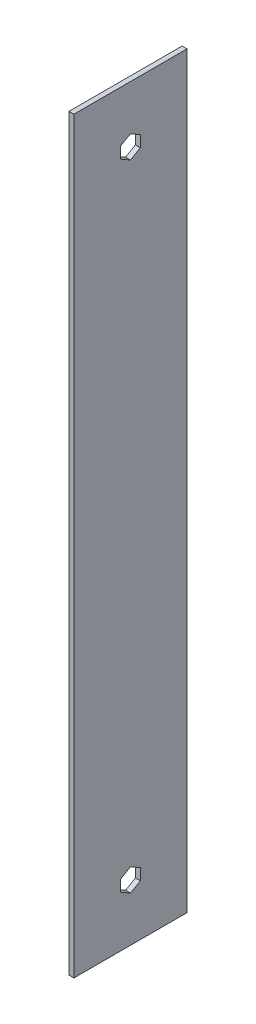
ISO-10303-21;
HEADER;
FILE_DESCRIPTION(('STEP AP214'),'2;1');
FILE_NAME('part.step','',(''),(''),'','','');
FILE_SCHEMA(('AUTOMOTIVE_DESIGN { 1 0 10303 214 1 1 1 1 }'));
ENDSEC;
DATA;
#1=APPLICATION_CONTEXT('core data for automotive mechanical design processes');
#2=APPLICATION_PROTOCOL_DEFINITION('international standard','automotive_design',2000,#1);
#3=PRODUCT_CONTEXT('',#1,'mechanical');
#4=PRODUCT('Part','Part','',(#3));
#5=PRODUCT_RELATED_PRODUCT_CATEGORY('part','',(#4));
#6=PRODUCT_DEFINITION_FORMATION('','',#4);
#7=PRODUCT_DEFINITION_CONTEXT('part definition',#1,'design');
#8=PRODUCT_DEFINITION('design','',#6,#7);
#9=PRODUCT_DEFINITION_SHAPE('','',#8);
#10=(LENGTH_UNIT() NAMED_UNIT(*) SI_UNIT(.MILLI.,.METRE.));
#11=(NAMED_UNIT(*) PLANE_ANGLE_UNIT() SI_UNIT($,.RADIAN.));
#12=(NAMED_UNIT(*) SI_UNIT($,.STERADIAN.) SOLID_ANGLE_UNIT());
#13=UNCERTAINTY_MEASURE_WITH_UNIT(LENGTH_MEASURE(1.E-05),#10,'distance_accuracy_value','');
#14=(GEOMETRIC_REPRESENTATION_CONTEXT(3) GLOBAL_UNCERTAINTY_ASSIGNED_CONTEXT((#13)) GLOBAL_UNIT_ASSIGNED_CONTEXT((#10,
#11,#12)) REPRESENTATION_CONTEXT('',''));
#15=CARTESIAN_POINT('',(0.,0.,0.));
#16=DIRECTION('',(0.,0.,1.));
#17=DIRECTION('',(1.,0.,0.));
#18=AXIS2_PLACEMENT_3D('',#15,#16,#17);
#19=CARTESIAN_POINT('',(1.5875,0.,0.));
#20=DIRECTION('',(1.,0.,0.));
#21=DIRECTION('',(0.,0.,-1.));
#22=AXIS2_PLACEMENT_3D('',#19,#20,#21);
#23=PLANE('',#22);
#24=DIRECTION('',(0.,-1.,0.));
#25=VECTOR('',#24,1.);
#26=CARTESIAN_POINT('',(1.5875,446.0875,36.5125000000001));
#27=LINE('',#26,#25);
#28=CARTESIAN_POINT('',(1.5875,446.0875,36.5125000000001));
#29=VERTEX_POINT('',#28);
#30=CARTESIAN_POINT('',(1.5875,-36.5125,36.5125));
#31=VERTEX_POINT('',#30);
#32=EDGE_CURVE('E242',#29,#31,#27,.T.);
#33=ORIENTED_EDGE('',*,*,#32,.T.);
#34=DIRECTION('',(0.,0.,-1.));
#35=VECTOR('',#34,1.);
#36=CARTESIAN_POINT('',(1.5875,-36.5125,36.5125));
#37=LINE('',#36,#35);
#38=CARTESIAN_POINT('',(1.5875,-36.5125,-36.5125));
#39=VERTEX_POINT('',#38);
#40=EDGE_CURVE('E245',#31,#39,#37,.T.);
#41=ORIENTED_EDGE('',*,*,#40,.T.);
#42=DIRECTION('',(0.,1.,0.));
#43=VECTOR('',#42,1.);
#44=CARTESIAN_POINT('',(1.5875,446.0875,-36.5124999999999));
#45=LINE('',#44,#43);
#46=CARTESIAN_POINT('',(1.5875,446.0875,-36.5124999999999));
#47=VERTEX_POINT('',#46);
#48=EDGE_CURVE('E248',#39,#47,#45,.T.);
#49=ORIENTED_EDGE('',*,*,#48,.T.);
#50=DIRECTION('',(0.,0.,1.));
#51=VECTOR('',#50,1.);
#52=CARTESIAN_POINT('',(1.5875,446.0875,36.5125000000001));
#53=LINE('',#52,#51);
#54=EDGE_CURVE('E250',#47,#29,#53,.T.);
#55=ORIENTED_EDGE('',*,*,#54,.T.);
#56=EDGE_LOOP('',(#33,#41,#49,#55));
#57=FACE_BOUND('',#56,.T.);
#58=DIRECTION('',(0.,-0.500000000000028,0.866025403784422));
#59=VECTOR('',#58,1.);
#60=CARTESIAN_POINT('',(1.5875,7.33234841870825,2.3952736495636E-13));
#61=LINE('',#60,#59);
#62=CARTESIAN_POINT('',(1.5875,7.33234841870825,2.3952736495636E-13));
#63=VERTEX_POINT('',#62);
#64=CARTESIAN_POINT('',(1.5875,3.666174209354,6.34999999999997));
#65=VERTEX_POINT('',#64);
#66=EDGE_CURVE('E199',#63,#65,#61,.T.);
#67=ORIENTED_EDGE('',*,*,#66,.F.);
#68=DIRECTION('',(0.,0.499999999999986,0.866025403784447));
#69=VECTOR('',#68,1.);
#70=CARTESIAN_POINT('',(1.5875,3.66617420935413,-6.34999999999999));
#71=LINE('',#70,#69);
#72=CARTESIAN_POINT('',(1.5875,3.66617420935413,-6.34999999999999));
#73=VERTEX_POINT('',#72);
#74=EDGE_CURVE('E197',#73,#63,#71,.T.);
#75=ORIENTED_EDGE('',*,*,#74,.F.);
#76=DIRECTION('',(0.,1.,0.));
#77=VECTOR('',#76,1.);
#78=CARTESIAN_POINT('',(1.5875,-3.66617420935413,-6.35));
#79=LINE('',#78,#77);
#80=CARTESIAN_POINT('',(1.5875,-3.66617420935413,-6.35));
#81=VERTEX_POINT('',#80);
#82=EDGE_CURVE('E209',#81,#73,#79,.T.);
#83=ORIENTED_EDGE('',*,*,#82,.F.);
#84=DIRECTION('',(0.,0.5,-0.866025403784439));
#85=VECTOR('',#84,1.);
#86=CARTESIAN_POINT('',(1.5875,-7.33234841870825,0.));
#87=LINE('',#86,#85);
#88=CARTESIAN_POINT('',(1.5875,-7.33234841870825,0.));
#89=VERTEX_POINT('',#88);
#90=EDGE_CURVE('E206',#89,#81,#87,.T.);
#91=ORIENTED_EDGE('',*,*,#90,.F.);
#92=DIRECTION('',(0.,-0.5,-0.866025403784439));
#93=VECTOR('',#92,1.);
#94=CARTESIAN_POINT('',(1.5875,-3.66617420935412,6.35));
#95=LINE('',#94,#93);
#96=CARTESIAN_POINT('',(1.5875,-3.66617420935412,6.35));
#97=VERTEX_POINT('',#96);
#98=EDGE_CURVE('E204',#97,#89,#95,.T.);
#99=ORIENTED_EDGE('',*,*,#98,.F.);
#100=DIRECTION('',(0.,-1.,0.));
#101=VECTOR('',#100,1.);
#102=CARTESIAN_POINT('',(1.5875,3.666174209354,6.34999999999997));
#103=LINE('',#102,#101);
#104=EDGE_CURVE('E202',#65,#97,#103,.T.);
#105=ORIENTED_EDGE('',*,*,#104,.F.);
#106=EDGE_LOOP('',(#67,#75,#83,#91,#99,#105));
#107=FACE_BOUND('',#106,.T.);
#108=DIRECTION('',(0.,0.499999999999997,-0.86602540378444));
#109=VECTOR('',#108,1.);
#110=CARTESIAN_POINT('',(1.5875,402.242651581292,0.));
#111=LINE('',#110,#109);
#112=CARTESIAN_POINT('',(1.5875,402.242651581292,0.));
#113=VERTEX_POINT('',#112);
#114=CARTESIAN_POINT('',(1.5875,405.908825790646,-6.35000000000002));
#115=VERTEX_POINT('',#114);
#116=EDGE_CURVE('E154',#113,#115,#111,.T.);
#117=ORIENTED_EDGE('',*,*,#116,.F.);
#118=DIRECTION('',(0.,-0.5,-0.866025403784439));
#119=VECTOR('',#118,1.);
#120=CARTESIAN_POINT('',(1.5875,405.908825790646,6.35));
#121=LINE('',#120,#119);
#122=CARTESIAN_POINT('',(1.5875,405.908825790646,6.35));
#123=VERTEX_POINT('',#122);
#124=EDGE_CURVE('E146',#123,#113,#121,.T.);
#125=ORIENTED_EDGE('',*,*,#124,.F.);
#126=DIRECTION('',(0.,-1.,0.));
#127=VECTOR('',#126,1.);
#128=CARTESIAN_POINT('',(1.5875,413.241174209354,6.35));
#129=LINE('',#128,#127);
#130=CARTESIAN_POINT('',(1.5875,413.241174209354,6.35));
#131=VERTEX_POINT('',#130);
#132=EDGE_CURVE('E175',#131,#123,#129,.T.);
#133=ORIENTED_EDGE('',*,*,#132,.F.);
#134=DIRECTION('',(0.,-0.499999999999999,0.866025403784439));
#135=VECTOR('',#134,1.);
#136=CARTESIAN_POINT('',(1.5875,416.907348418708,0.));
#137=LINE('',#136,#135);
#138=CARTESIAN_POINT('',(1.5875,416.907348418708,0.));
#139=VERTEX_POINT('',#138);
#140=EDGE_CURVE('E173',#139,#131,#137,.T.);
#141=ORIENTED_EDGE('',*,*,#140,.F.);
#142=DIRECTION('',(0.,0.499999999999998,0.86602540378444));
#143=VECTOR('',#142,1.);
#144=CARTESIAN_POINT('',(1.5875,413.241174209354,-6.35000000000002));
#145=LINE('',#144,#143);
#146=CARTESIAN_POINT('',(1.5875,413.241174209354,-6.35000000000002));
#147=VERTEX_POINT('',#146);
#148=EDGE_CURVE('E169',#147,#139,#145,.T.);
#149=ORIENTED_EDGE('',*,*,#148,.F.);
#150=DIRECTION('',(0.,1.,0.));
#151=VECTOR('',#150,1.);
#152=CARTESIAN_POINT('',(1.5875,405.908825790646,-6.35000000000002));
#153=LINE('',#152,#151);
#154=EDGE_CURVE('E167',#115,#147,#153,.T.);
#155=ORIENTED_EDGE('',*,*,#154,.F.);
#156=EDGE_LOOP('',(#117,#125,#133,#141,#149,#155));
#157=FACE_BOUND('',#156,.T.);
#158=ADVANCED_FACE('F33',(#57,#107,#157),#23,.T.);
#159=CARTESIAN_POINT('',(-1.5875,0.,0.));
#160=DIRECTION('',(1.,0.,0.));
#161=DIRECTION('',(0.,0.,-1.));
#162=AXIS2_PLACEMENT_3D('',#159,#160,#161);
#163=PLANE('',#162);
#164=DIRECTION('',(0.,0.499999999999986,0.866025403784447));
#165=VECTOR('',#164,1.);
#166=CARTESIAN_POINT('',(-1.5875,3.66617420935413,-6.34999999999999));
#167=LINE('',#166,#165);
#168=CARTESIAN_POINT('',(-1.5875,3.66617420935413,-6.34999999999999));
#169=VERTEX_POINT('',#168);
#170=CARTESIAN_POINT('',(-1.5875,7.33234841870825,2.3952736495636E-13));
#171=VERTEX_POINT('',#170);
#172=EDGE_CURVE('E162',#169,#171,#167,.T.);
#173=ORIENTED_EDGE('',*,*,#172,.T.);
#174=DIRECTION('',(0.,-0.500000000000028,0.866025403784422));
#175=VECTOR('',#174,1.);
#176=CARTESIAN_POINT('',(-1.5875,7.33234841870825,2.3952736495636E-13));
#177=LINE('',#176,#175);
#178=CARTESIAN_POINT('',(-1.5875,3.666174209354,6.34999999999997));
#179=VERTEX_POINT('',#178);
#180=EDGE_CURVE('E214',#171,#179,#177,.T.);
#181=ORIENTED_EDGE('',*,*,#180,.T.);
#182=DIRECTION('',(0.,-1.,0.));
#183=VECTOR('',#182,1.);
#184=CARTESIAN_POINT('',(-1.5875,3.666174209354,6.34999999999997));
#185=LINE('',#184,#183);
#186=CARTESIAN_POINT('',(-1.5875,-3.66617420935412,6.35));
#187=VERTEX_POINT('',#186);
#188=EDGE_CURVE('E217',#179,#187,#185,.T.);
#189=ORIENTED_EDGE('',*,*,#188,.T.);
#190=DIRECTION('',(0.,-0.5,-0.866025403784439));
#191=VECTOR('',#190,1.);
#192=CARTESIAN_POINT('',(-1.5875,-3.66617420935412,6.35));
#193=LINE('',#192,#191);
#194=CARTESIAN_POINT('',(-1.5875,-7.33234841870825,0.));
#195=VERTEX_POINT('',#194);
#196=EDGE_CURVE('E220',#187,#195,#193,.T.);
#197=ORIENTED_EDGE('',*,*,#196,.T.);
#198=DIRECTION('',(0.,0.5,-0.866025403784439));
#199=VECTOR('',#198,1.);
#200=CARTESIAN_POINT('',(-1.5875,-7.33234841870825,0.));
#201=LINE('',#200,#199);
#202=CARTESIAN_POINT('',(-1.5875,-3.66617420935413,-6.35));
#203=VERTEX_POINT('',#202);
#204=EDGE_CURVE('E223',#195,#203,#201,.T.);
#205=ORIENTED_EDGE('',*,*,#204,.T.);
#206=DIRECTION('',(0.,1.,0.));
#207=VECTOR('',#206,1.);
#208=CARTESIAN_POINT('',(-1.5875,-3.66617420935413,-6.35));
#209=LINE('',#208,#207);
#210=EDGE_CURVE('E200',#203,#169,#209,.T.);
#211=ORIENTED_EDGE('',*,*,#210,.T.);
#212=EDGE_LOOP('',(#173,#181,#189,#197,#205,#211));
#213=FACE_BOUND('',#212,.T.);
#214=DIRECTION('',(0.,-1.,0.));
#215=VECTOR('',#214,1.);
#216=CARTESIAN_POINT('',(-1.5875,446.0875,36.5125000000001));
#217=LINE('',#216,#215);
#218=CARTESIAN_POINT('',(-1.5875,446.0875,36.5125000000001));
#219=VERTEX_POINT('',#218);
#220=CARTESIAN_POINT('',(-1.5875,-36.5125,36.5125));
#221=VERTEX_POINT('',#220);
#222=EDGE_CURVE('E241',#219,#221,#217,.T.);
#223=ORIENTED_EDGE('',*,*,#222,.F.);
#224=DIRECTION('',(0.,0.,1.));
#225=VECTOR('',#224,1.);
#226=CARTESIAN_POINT('',(-1.5875,446.0875,36.5125000000001));
#227=LINE('',#226,#225);
#228=CARTESIAN_POINT('',(-1.5875,446.0875,-36.5124999999999));
#229=VERTEX_POINT('',#228);
#230=EDGE_CURVE('E246',#229,#219,#227,.T.);
#231=ORIENTED_EDGE('',*,*,#230,.F.);
#232=DIRECTION('',(0.,1.,0.));
#233=VECTOR('',#232,1.);
#234=CARTESIAN_POINT('',(-1.5875,446.0875,-36.5124999999999));
#235=LINE('',#234,#233);
#236=CARTESIAN_POINT('',(-1.5875,-36.5125,-36.5125));
#237=VERTEX_POINT('',#236);
#238=EDGE_CURVE('E257',#237,#229,#235,.T.);
#239=ORIENTED_EDGE('',*,*,#238,.F.);
#240=DIRECTION('',(0.,0.,-1.));
#241=VECTOR('',#240,1.);
#242=CARTESIAN_POINT('',(-1.5875,-36.5125,36.5125));
#243=LINE('',#242,#241);
#244=EDGE_CURVE('E255',#221,#237,#243,.T.);
#245=ORIENTED_EDGE('',*,*,#244,.F.);
#246=EDGE_LOOP('',(#223,#231,#239,#245));
#247=FACE_BOUND('',#246,.T.);
#248=DIRECTION('',(0.,-0.5,-0.866025403784439));
#249=VECTOR('',#248,1.);
#250=CARTESIAN_POINT('',(-1.5875,405.908825790646,6.35));
#251=LINE('',#250,#249);
#252=CARTESIAN_POINT('',(-1.5875,405.908825790646,6.35));
#253=VERTEX_POINT('',#252);
#254=CARTESIAN_POINT('',(-1.5875,402.242651581292,0.));
#255=VERTEX_POINT('',#254);
#256=EDGE_CURVE('E56',#253,#255,#251,.T.);
#257=ORIENTED_EDGE('',*,*,#256,.T.);
#258=DIRECTION('',(0.,0.499999999999997,-0.86602540378444));
#259=VECTOR('',#258,1.);
#260=CARTESIAN_POINT('',(-1.5875,402.242651581292,0.));
#261=LINE('',#260,#259);
#262=CARTESIAN_POINT('',(-1.5875,405.908825790646,-6.35000000000002));
#263=VERTEX_POINT('',#262);
#264=EDGE_CURVE('E161',#255,#263,#261,.T.);
#265=ORIENTED_EDGE('',*,*,#264,.T.);
#266=DIRECTION('',(0.,1.,0.));
#267=VECTOR('',#266,1.);
#268=CARTESIAN_POINT('',(-1.5875,405.908825790646,-6.35000000000002));
#269=LINE('',#268,#267);
#270=CARTESIAN_POINT('',(-1.5875,413.241174209354,-6.35000000000002));
#271=VERTEX_POINT('',#270);
#272=EDGE_CURVE('E179',#263,#271,#269,.T.);
#273=ORIENTED_EDGE('',*,*,#272,.T.);
#274=DIRECTION('',(0.,0.499999999999998,0.86602540378444));
#275=VECTOR('',#274,1.);
#276=CARTESIAN_POINT('',(-1.5875,413.241174209354,-6.35000000000002));
#277=LINE('',#276,#275);
#278=CARTESIAN_POINT('',(-1.5875,416.907348418708,0.));
#279=VERTEX_POINT('',#278);
#280=EDGE_CURVE('E182',#271,#279,#277,.T.);
#281=ORIENTED_EDGE('',*,*,#280,.T.);
#282=DIRECTION('',(0.,-0.499999999999999,0.866025403784439));
#283=VECTOR('',#282,1.);
#284=CARTESIAN_POINT('',(-1.5875,416.907348418708,0.));
#285=LINE('',#284,#283);
#286=CARTESIAN_POINT('',(-1.5875,413.241174209354,6.35));
#287=VERTEX_POINT('',#286);
#288=EDGE_CURVE('E185',#279,#287,#285,.T.);
#289=ORIENTED_EDGE('',*,*,#288,.T.);
#290=DIRECTION('',(0.,-1.,0.));
#291=VECTOR('',#290,1.);
#292=CARTESIAN_POINT('',(-1.5875,413.241174209354,6.35));
#293=LINE('',#292,#291);
#294=EDGE_CURVE('E155',#287,#253,#293,.T.);
#295=ORIENTED_EDGE('',*,*,#294,.T.);
#296=EDGE_LOOP('',(#257,#265,#273,#281,#289,#295));
#297=FACE_BOUND('',#296,.T.);
#298=ADVANCED_FACE('F275',(#213,#247,#297),#163,.F.);
#299=CARTESIAN_POINT('',(1.5875,446.0875,36.5125000000001));
#300=DIRECTION('',(0.,0.,-1.));
#301=DIRECTION('',(0.,1.,0.));
#302=AXIS2_PLACEMENT_3D('',#299,#300,#301);
#303=PLANE('',#302);
#304=ORIENTED_EDGE('',*,*,#222,.T.);
#305=DIRECTION('',(-1.,0.,0.));
#306=VECTOR('',#305,1.);
#307=CARTESIAN_POINT('',(1.5875,-36.5125,36.5125));
#308=LINE('',#307,#306);
#309=EDGE_CURVE('E11',#31,#221,#308,.T.);
#310=ORIENTED_EDGE('',*,*,#309,.F.);
#311=ORIENTED_EDGE('',*,*,#32,.F.);
#312=DIRECTION('',(-1.,0.,0.));
#313=VECTOR('',#312,1.);
#314=CARTESIAN_POINT('',(1.5875,446.0875,36.5125000000001));
#315=LINE('',#314,#313);
#316=EDGE_CURVE('E252',#29,#219,#315,.T.);
#317=ORIENTED_EDGE('',*,*,#316,.T.);
#318=EDGE_LOOP('',(#304,#310,#311,#317));
#319=FACE_BOUND('',#318,.T.);
#320=ADVANCED_FACE('F35',(#319),#303,.F.);
#321=CARTESIAN_POINT('',(1.5875,-36.5125,36.5125));
#322=DIRECTION('',(0.,1.,0.));
#323=DIRECTION('',(0.,0.,1.));
#324=AXIS2_PLACEMENT_3D('',#321,#322,#323);
#325=PLANE('',#324);
#326=ORIENTED_EDGE('',*,*,#244,.T.);
#327=DIRECTION('',(-1.,0.,0.));
#328=VECTOR('',#327,1.);
#329=CARTESIAN_POINT('',(1.5875,-36.5125,-36.5125));
#330=LINE('',#329,#328);
#331=EDGE_CURVE('E41',#39,#237,#330,.T.);
#332=ORIENTED_EDGE('',*,*,#331,.F.);
#333=ORIENTED_EDGE('',*,*,#40,.F.);
#334=ORIENTED_EDGE('',*,*,#309,.T.);
#335=EDGE_LOOP('',(#326,#332,#333,#334));
#336=FACE_BOUND('',#335,.T.);
#337=ADVANCED_FACE('F286',(#336),#325,.F.);
#338=CARTESIAN_POINT('',(1.5875,446.0875,-36.5124999999999));
#339=DIRECTION('',(0.,0.,1.));
#340=DIRECTION('',(0.,-1.,0.));
#341=AXIS2_PLACEMENT_3D('',#338,#339,#340);
#342=PLANE('',#341);
#343=ORIENTED_EDGE('',*,*,#238,.T.);
#344=DIRECTION('',(-1.,0.,0.));
#345=VECTOR('',#344,1.);
#346=CARTESIAN_POINT('',(1.5875,446.0875,-36.5124999999999));
#347=LINE('',#346,#345);
#348=EDGE_CURVE('E262',#47,#229,#347,.T.);
#349=ORIENTED_EDGE('',*,*,#348,.F.);
#350=ORIENTED_EDGE('',*,*,#48,.F.);
#351=ORIENTED_EDGE('',*,*,#331,.T.);
#352=EDGE_LOOP('',(#343,#349,#350,#351));
#353=FACE_BOUND('',#352,.T.);
#354=ADVANCED_FACE('F269',(#353),#342,.F.);
#355=CARTESIAN_POINT('',(1.5875,446.0875,36.5125000000001));
#356=DIRECTION('',(0.,-1.,0.));
#357=DIRECTION('',(0.,0.,-1.));
#358=AXIS2_PLACEMENT_3D('',#355,#356,#357);
#359=PLANE('',#358);
#360=ORIENTED_EDGE('',*,*,#230,.T.);
#361=ORIENTED_EDGE('',*,*,#316,.F.);
#362=ORIENTED_EDGE('',*,*,#54,.F.);
#363=ORIENTED_EDGE('',*,*,#348,.T.);
#364=EDGE_LOOP('',(#360,#361,#362,#363));
#365=FACE_BOUND('',#364,.T.);
#366=ADVANCED_FACE('F279',(#365),#359,.F.);
#367=CARTESIAN_POINT('',(1.5875,3.66617420935413,-6.34999999999999));
#368=DIRECTION('',(0.,-0.866025403784447,0.499999999999986));
#369=DIRECTION('',(0.,-0.499999999999986,-0.866025403784447));
#370=AXIS2_PLACEMENT_3D('',#367,#368,#369);
#371=PLANE('',#370);
#372=ORIENTED_EDGE('',*,*,#172,.F.);
#373=DIRECTION('',(-1.,0.,0.));
#374=VECTOR('',#373,1.);
#375=CARTESIAN_POINT('',(1.5875,3.66617420935413,-6.34999999999999));
#376=LINE('',#375,#374);
#377=EDGE_CURVE('E211',#73,#169,#376,.T.);
#378=ORIENTED_EDGE('',*,*,#377,.F.);
#379=ORIENTED_EDGE('',*,*,#74,.T.);
#380=DIRECTION('',(-1.,0.,0.));
#381=VECTOR('',#380,1.);
#382=CARTESIAN_POINT('',(1.5875,7.33234841870825,2.3952736495636E-13));
#383=LINE('',#382,#381);
#384=EDGE_CURVE('E238',#63,#171,#383,.T.);
#385=ORIENTED_EDGE('',*,*,#384,.T.);
#386=EDGE_LOOP('',(#372,#378,#379,#385));
#387=FACE_BOUND('',#386,.T.);
#388=ADVANCED_FACE('F301',(#387),#371,.T.);
#389=CARTESIAN_POINT('',(1.5875,7.33234841870825,2.3952736495636E-13));
#390=DIRECTION('',(0.,-0.866025403784422,-0.500000000000028));
#391=DIRECTION('',(0.,0.500000000000028,-0.866025403784422));
#392=AXIS2_PLACEMENT_3D('',#389,#390,#391);
#393=PLANE('',#392);
#394=ORIENTED_EDGE('',*,*,#180,.F.);
#395=ORIENTED_EDGE('',*,*,#384,.F.);
#396=ORIENTED_EDGE('',*,*,#66,.T.);
#397=DIRECTION('',(-1.,0.,0.));
#398=VECTOR('',#397,1.);
#399=CARTESIAN_POINT('',(1.5875,3.666174209354,6.34999999999997));
#400=LINE('',#399,#398);
#401=EDGE_CURVE('E236',#65,#179,#400,.T.);
#402=ORIENTED_EDGE('',*,*,#401,.T.);
#403=EDGE_LOOP('',(#394,#395,#396,#402));
#404=FACE_BOUND('',#403,.T.);
#405=ADVANCED_FACE('F308',(#404),#393,.T.);
#406=CARTESIAN_POINT('',(1.5875,3.666174209354,6.34999999999997));
#407=DIRECTION('',(0.,0.,-1.));
#408=DIRECTION('',(0.,1.,0.));
#409=AXIS2_PLACEMENT_3D('',#406,#407,#408);
#410=PLANE('',#409);
#411=ORIENTED_EDGE('',*,*,#188,.F.);
#412=ORIENTED_EDGE('',*,*,#401,.F.);
#413=ORIENTED_EDGE('',*,*,#104,.T.);
#414=DIRECTION('',(-1.,0.,0.));
#415=VECTOR('',#414,1.);
#416=CARTESIAN_POINT('',(1.5875,-3.66617420935412,6.35));
#417=LINE('',#416,#415);
#418=EDGE_CURVE('E234',#97,#187,#417,.T.);
#419=ORIENTED_EDGE('',*,*,#418,.T.);
#420=EDGE_LOOP('',(#411,#412,#413,#419));
#421=FACE_BOUND('',#420,.T.);
#422=ADVANCED_FACE('F313',(#421),#410,.T.);
#423=CARTESIAN_POINT('',(1.5875,-3.66617420935412,6.35));
#424=DIRECTION('',(0.,0.866025403784439,-0.5));
#425=DIRECTION('',(0.,0.5,0.866025403784439));
#426=AXIS2_PLACEMENT_3D('',#423,#424,#425);
#427=PLANE('',#426);
#428=ORIENTED_EDGE('',*,*,#196,.F.);
#429=ORIENTED_EDGE('',*,*,#418,.F.);
#430=ORIENTED_EDGE('',*,*,#98,.T.);
#431=DIRECTION('',(-1.,0.,0.));
#432=VECTOR('',#431,1.);
#433=CARTESIAN_POINT('',(1.5875,-7.33234841870825,0.));
#434=LINE('',#433,#432);
#435=EDGE_CURVE('E232',#89,#195,#434,.T.);
#436=ORIENTED_EDGE('',*,*,#435,.T.);
#437=EDGE_LOOP('',(#428,#429,#430,#436));
#438=FACE_BOUND('',#437,.T.);
#439=ADVANCED_FACE('F336',(#438),#427,.T.);
#440=CARTESIAN_POINT('',(1.5875,-7.33234841870825,0.));
#441=DIRECTION('',(0.,0.866025403784439,0.5));
#442=DIRECTION('',(0.,-0.5,0.866025403784439));
#443=AXIS2_PLACEMENT_3D('',#440,#441,#442);
#444=PLANE('',#443);
#445=ORIENTED_EDGE('',*,*,#204,.F.);
#446=ORIENTED_EDGE('',*,*,#435,.F.);
#447=ORIENTED_EDGE('',*,*,#90,.T.);
#448=DIRECTION('',(-1.,0.,0.));
#449=VECTOR('',#448,1.);
#450=CARTESIAN_POINT('',(1.5875,-3.66617420935413,-6.35));
#451=LINE('',#450,#449);
#452=EDGE_CURVE('E230',#81,#203,#451,.T.);
#453=ORIENTED_EDGE('',*,*,#452,.T.);
#454=EDGE_LOOP('',(#445,#446,#447,#453));
#455=FACE_BOUND('',#454,.T.);
#456=ADVANCED_FACE('F326',(#455),#444,.T.);
#457=CARTESIAN_POINT('',(1.5875,-3.66617420935413,-6.35));
#458=DIRECTION('',(0.,0.,1.));
#459=DIRECTION('',(0.,-1.,0.));
#460=AXIS2_PLACEMENT_3D('',#457,#458,#459);
#461=PLANE('',#460);
#462=ORIENTED_EDGE('',*,*,#210,.F.);
#463=ORIENTED_EDGE('',*,*,#452,.F.);
#464=ORIENTED_EDGE('',*,*,#82,.T.);
#465=ORIENTED_EDGE('',*,*,#377,.T.);
#466=EDGE_LOOP('',(#462,#463,#464,#465));
#467=FACE_BOUND('',#466,.T.);
#468=ADVANCED_FACE('F320',(#467),#461,.T.);
#469=CARTESIAN_POINT('',(1.5875,405.908825790646,6.35));
#470=DIRECTION('',(0.,0.866025403784439,-0.5));
#471=DIRECTION('',(0.,0.5,0.866025403784439));
#472=AXIS2_PLACEMENT_3D('',#469,#470,#471);
#473=PLANE('',#472);
#474=ORIENTED_EDGE('',*,*,#256,.F.);
#475=DIRECTION('',(-1.,0.,0.));
#476=VECTOR('',#475,1.);
#477=CARTESIAN_POINT('',(1.5875,405.908825790646,6.35));
#478=LINE('',#477,#476);
#479=EDGE_CURVE('E150',#123,#253,#478,.T.);
#480=ORIENTED_EDGE('',*,*,#479,.F.);
#481=ORIENTED_EDGE('',*,*,#124,.T.);
#482=DIRECTION('',(-1.,0.,0.));
#483=VECTOR('',#482,1.);
#484=CARTESIAN_POINT('',(1.5875,402.242651581292,0.));
#485=LINE('',#484,#483);
#486=EDGE_CURVE('E149',#113,#255,#485,.T.);
#487=ORIENTED_EDGE('',*,*,#486,.T.);
#488=EDGE_LOOP('',(#474,#480,#481,#487));
#489=FACE_BOUND('',#488,.T.);
#490=ADVANCED_FACE('F148',(#489),#473,.T.);
#491=CARTESIAN_POINT('',(1.5875,402.242651581292,0.));
#492=DIRECTION('',(0.,0.86602540378444,0.499999999999997));
#493=DIRECTION('',(0.,-0.499999999999997,0.86602540378444));
#494=AXIS2_PLACEMENT_3D('',#491,#492,#493);
#495=PLANE('',#494);
#496=ORIENTED_EDGE('',*,*,#264,.F.);
#497=ORIENTED_EDGE('',*,*,#486,.F.);
#498=ORIENTED_EDGE('',*,*,#116,.T.);
#499=DIRECTION('',(-1.,0.,0.));
#500=VECTOR('',#499,1.);
#501=CARTESIAN_POINT('',(1.5875,405.908825790646,-6.35000000000002));
#502=LINE('',#501,#500);
#503=EDGE_CURVE('E163',#115,#263,#502,.T.);
#504=ORIENTED_EDGE('',*,*,#503,.T.);
#505=EDGE_LOOP('',(#496,#497,#498,#504));
#506=FACE_BOUND('',#505,.T.);
#507=ADVANCED_FACE('F158',(#506),#495,.T.);
#508=CARTESIAN_POINT('',(1.5875,405.908825790646,-6.35000000000002));
#509=DIRECTION('',(0.,0.,1.));
#510=DIRECTION('',(0.,-1.,0.));
#511=AXIS2_PLACEMENT_3D('',#508,#509,#510);
#512=PLANE('',#511);
#513=ORIENTED_EDGE('',*,*,#272,.F.);
#514=ORIENTED_EDGE('',*,*,#503,.F.);
#515=ORIENTED_EDGE('',*,*,#154,.T.);
#516=DIRECTION('',(-1.,0.,0.));
#517=VECTOR('',#516,1.);
#518=CARTESIAN_POINT('',(1.5875,413.241174209354,-6.35000000000002));
#519=LINE('',#518,#517);
#520=EDGE_CURVE('E194',#147,#271,#519,.T.);
#521=ORIENTED_EDGE('',*,*,#520,.T.);
#522=EDGE_LOOP('',(#513,#514,#515,#521));
#523=FACE_BOUND('',#522,.T.);
#524=ADVANCED_FACE('F352',(#523),#512,.T.);
#525=CARTESIAN_POINT('',(1.5875,413.241174209354,-6.35000000000002));
#526=DIRECTION('',(0.,-0.86602540378444,0.499999999999998));
#527=DIRECTION('',(0.,-0.499999999999998,-0.86602540378444));
#528=AXIS2_PLACEMENT_3D('',#525,#526,#527);
#529=PLANE('',#528);
#530=ORIENTED_EDGE('',*,*,#280,.F.);
#531=ORIENTED_EDGE('',*,*,#520,.F.);
#532=ORIENTED_EDGE('',*,*,#148,.T.);
#533=DIRECTION('',(-1.,0.,0.));
#534=VECTOR('',#533,1.);
#535=CARTESIAN_POINT('',(1.5875,416.907348418708,0.));
#536=LINE('',#535,#534);
#537=EDGE_CURVE('E192',#139,#279,#536,.T.);
#538=ORIENTED_EDGE('',*,*,#537,.T.);
#539=EDGE_LOOP('',(#530,#531,#532,#538));
#540=FACE_BOUND('',#539,.T.);
#541=ADVANCED_FACE('F355',(#540),#529,.T.);
#542=CARTESIAN_POINT('',(1.5875,416.907348418708,0.));
#543=DIRECTION('',(0.,-0.866025403784439,-0.499999999999999));
#544=DIRECTION('',(0.,0.499999999999999,-0.86602540378444));
#545=AXIS2_PLACEMENT_3D('',#542,#543,#544);
#546=PLANE('',#545);
#547=ORIENTED_EDGE('',*,*,#288,.F.);
#548=ORIENTED_EDGE('',*,*,#537,.F.);
#549=ORIENTED_EDGE('',*,*,#140,.T.);
#550=DIRECTION('',(-1.,0.,0.));
#551=VECTOR('',#550,1.);
#552=CARTESIAN_POINT('',(1.5875,413.241174209354,6.35));
#553=LINE('',#552,#551);
#554=EDGE_CURVE('E48',#131,#287,#553,.T.);
#555=ORIENTED_EDGE('',*,*,#554,.T.);
#556=EDGE_LOOP('',(#547,#548,#549,#555));
#557=FACE_BOUND('',#556,.T.);
#558=ADVANCED_FACE('F359',(#557),#546,.T.);
#559=CARTESIAN_POINT('',(1.5875,413.241174209354,6.35));
#560=DIRECTION('',(0.,0.,-1.));
#561=DIRECTION('',(-1.,0.,0.));
#562=AXIS2_PLACEMENT_3D('',#559,#560,#561);
#563=PLANE('',#562);
#564=ORIENTED_EDGE('',*,*,#294,.F.);
#565=ORIENTED_EDGE('',*,*,#554,.F.);
#566=ORIENTED_EDGE('',*,*,#132,.T.);
#567=ORIENTED_EDGE('',*,*,#479,.T.);
#568=EDGE_LOOP('',(#564,#565,#566,#567));
#569=FACE_BOUND('',#568,.T.);
#570=ADVANCED_FACE('F363',(#569),#563,.T.);
#571=CLOSED_SHELL('',(#158,#298,#320,#337,#354,#366,#388,#405,#422,#439,#456,#468,#490,#507,
#524,#541,#558,#570));
#572=MANIFOLD_SOLID_BREP('B2',#571);
#573=ADVANCED_BREP_SHAPE_REPRESENTATION('',(#18,#572),#14);
#574=SHAPE_DEFINITION_REPRESENTATION(#9,#573);
ENDSEC;
END-ISO-10303-21;
